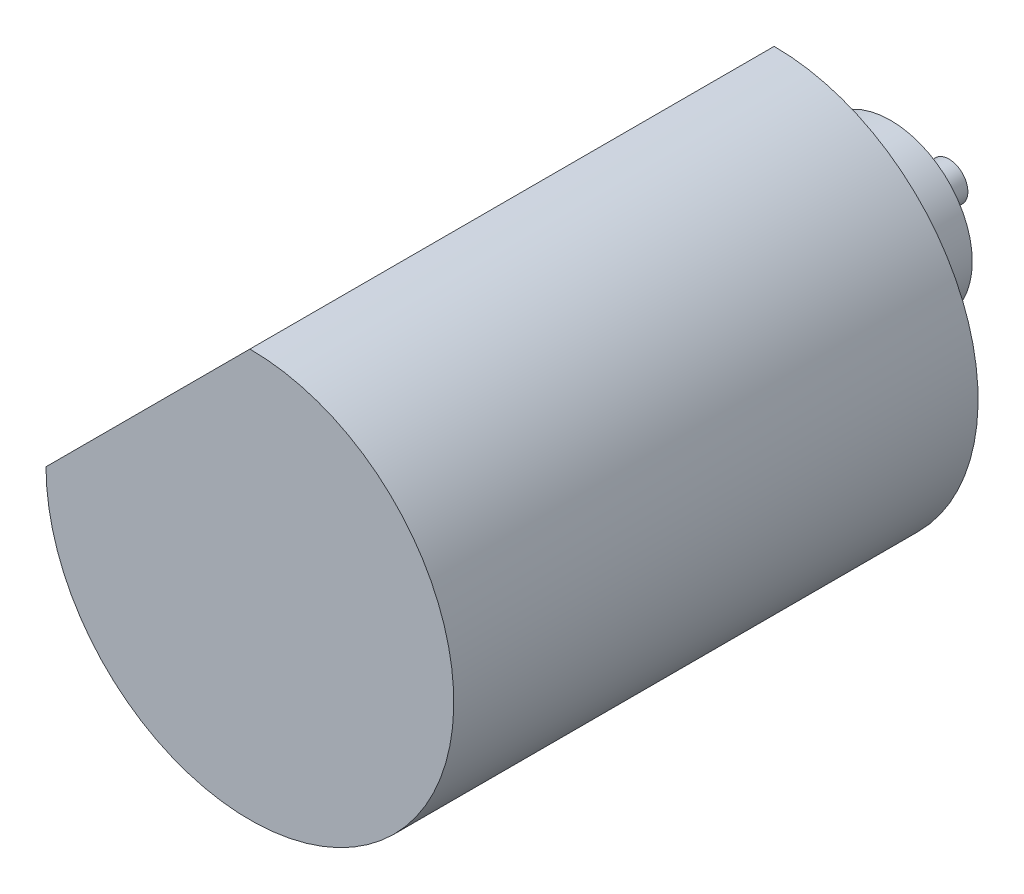
ISO-10303-21;
HEADER;
FILE_DESCRIPTION(('STEP AP214'),'2;1');
FILE_NAME('part.step','',(''),(''),'','','');
FILE_SCHEMA(('AUTOMOTIVE_DESIGN { 1 0 10303 214 1 1 1 1 }'));
ENDSEC;
DATA;
#1=APPLICATION_CONTEXT('core data for automotive mechanical design processes');
#2=APPLICATION_PROTOCOL_DEFINITION('international standard','automotive_design',2000,#1);
#3=PRODUCT_CONTEXT('',#1,'mechanical');
#4=PRODUCT('Part','Part','',(#3));
#5=PRODUCT_RELATED_PRODUCT_CATEGORY('part','',(#4));
#6=PRODUCT_DEFINITION_FORMATION('','',#4);
#7=PRODUCT_DEFINITION_CONTEXT('part definition',#1,'design');
#8=PRODUCT_DEFINITION('design','',#6,#7);
#9=PRODUCT_DEFINITION_SHAPE('','',#8);
#10=(LENGTH_UNIT() NAMED_UNIT(*) SI_UNIT(.MILLI.,.METRE.));
#11=(NAMED_UNIT(*) PLANE_ANGLE_UNIT() SI_UNIT($,.RADIAN.));
#12=(NAMED_UNIT(*) SI_UNIT($,.STERADIAN.) SOLID_ANGLE_UNIT());
#13=UNCERTAINTY_MEASURE_WITH_UNIT(LENGTH_MEASURE(1.E-05),#10,'distance_accuracy_value','');
#14=(GEOMETRIC_REPRESENTATION_CONTEXT(3) GLOBAL_UNCERTAINTY_ASSIGNED_CONTEXT((#13)) GLOBAL_UNIT_ASSIGNED_CONTEXT((#10,
#11,#12)) REPRESENTATION_CONTEXT('',''));
#15=CARTESIAN_POINT('',(0.,0.,0.));
#16=DIRECTION('',(0.,0.,1.));
#17=DIRECTION('',(1.,0.,0.));
#18=AXIS2_PLACEMENT_3D('',#15,#16,#17);
#19=CARTESIAN_POINT('',(0.,0.,45.));
#20=DIRECTION('',(0.,0.,-1.));
#21=DIRECTION('',(-1.,0.,0.));
#22=AXIS2_PLACEMENT_3D('',#19,#20,#21);
#23=CYLINDRICAL_SURFACE('',#22,17.5);
#24=CARTESIAN_POINT('',(0.,0.,0.));
#25=DIRECTION('',(0.,0.,1.));
#26=DIRECTION('',(1.,0.,0.));
#27=AXIS2_PLACEMENT_3D('',#24,#25,#26);
#28=CIRCLE('',#27,17.5);
#29=CARTESIAN_POINT('',(-17.5,0.,0.));
#30=VERTEX_POINT('',#29);
#31=CARTESIAN_POINT('',(0.,17.5,0.));
#32=VERTEX_POINT('',#31);
#33=EDGE_CURVE('E68',#30,#32,#28,.T.);
#34=ORIENTED_EDGE('',*,*,#33,.T.);
#35=DIRECTION('',(0.,0.,-1.));
#36=VECTOR('',#35,1.);
#37=CARTESIAN_POINT('',(0.,17.5,45.));
#38=LINE('',#37,#36);
#39=CARTESIAN_POINT('',(0.,17.5,45.));
#40=VERTEX_POINT('',#39);
#41=EDGE_CURVE('E43',#40,#32,#38,.T.);
#42=ORIENTED_EDGE('',*,*,#41,.F.);
#43=CARTESIAN_POINT('',(0.,0.,45.));
#44=DIRECTION('',(0.,0.,1.));
#45=DIRECTION('',(1.,0.,0.));
#46=AXIS2_PLACEMENT_3D('',#43,#44,#45);
#47=CIRCLE('',#46,17.5);
#48=CARTESIAN_POINT('',(-17.5,0.,45.));
#49=VERTEX_POINT('',#48);
#50=EDGE_CURVE('E67',#49,#40,#47,.T.);
#51=ORIENTED_EDGE('',*,*,#50,.F.);
#52=DIRECTION('',(0.,0.,-1.));
#53=VECTOR('',#52,1.);
#54=CARTESIAN_POINT('',(-17.5,0.,45.));
#55=LINE('',#54,#53);
#56=EDGE_CURVE('E63',#49,#30,#55,.T.);
#57=ORIENTED_EDGE('',*,*,#56,.T.);
#58=EDGE_LOOP('',(#34,#42,#51,#57));
#59=FACE_BOUND('',#58,.T.);
#60=ADVANCED_FACE('F35',(#59),#23,.T.);
#61=CARTESIAN_POINT('',(0.,17.5,45.));
#62=DIRECTION('',(0.707106781186546,-0.707106781186549,0.));
#63=DIRECTION('',(0.707106781186549,0.707106781186546,0.));
#64=AXIS2_PLACEMENT_3D('',#61,#62,#63);
#65=PLANE('',#64);
#66=DIRECTION('',(-0.707106781186549,-0.707106781186546,0.));
#67=VECTOR('',#66,1.);
#68=CARTESIAN_POINT('',(0.,17.5,0.));
#69=LINE('',#68,#67);
#70=EDGE_CURVE('E58',#32,#30,#69,.T.);
#71=ORIENTED_EDGE('',*,*,#70,.T.);
#72=ORIENTED_EDGE('',*,*,#56,.F.);
#73=DIRECTION('',(-0.707106781186549,-0.707106781186546,0.));
#74=VECTOR('',#73,1.);
#75=CARTESIAN_POINT('',(0.,17.5,45.));
#76=LINE('',#75,#74);
#77=EDGE_CURVE('E50',#40,#49,#76,.T.);
#78=ORIENTED_EDGE('',*,*,#77,.F.);
#79=ORIENTED_EDGE('',*,*,#41,.T.);
#80=EDGE_LOOP('',(#71,#72,#78,#79));
#81=FACE_BOUND('',#80,.T.);
#82=ADVANCED_FACE('F62',(#81),#65,.F.);
#83=CARTESIAN_POINT('',(0.,0.,45.));
#84=DIRECTION('',(0.,0.,1.));
#85=DIRECTION('',(1.,0.,0.));
#86=AXIS2_PLACEMENT_3D('',#83,#84,#85);
#87=PLANE('',#86);
#88=ORIENTED_EDGE('',*,*,#50,.T.);
#89=ORIENTED_EDGE('',*,*,#77,.T.);
#90=EDGE_LOOP('',(#88,#89));
#91=FACE_BOUND('',#90,.T.);
#92=ADVANCED_FACE('F89',(#91),#87,.T.);
#93=CARTESIAN_POINT('',(0.,0.,0.));
#94=DIRECTION('',(0.,0.,1.));
#95=DIRECTION('',(1.,0.,0.));
#96=AXIS2_PLACEMENT_3D('',#93,#94,#95);
#97=PLANE('',#96);
#98=CARTESIAN_POINT('',(0.,0.,0.));
#99=DIRECTION('',(0.,0.,1.));
#100=DIRECTION('',(1.,0.,0.));
#101=AXIS2_PLACEMENT_3D('',#98,#99,#100);
#102=CIRCLE('',#101,7.);
#103=CARTESIAN_POINT('',(7.,0.,0.));
#104=VERTEX_POINT('',#103);
#105=EDGE_CURVE('E11',#104,#104,#102,.F.);
#106=ORIENTED_EDGE('',*,*,#105,.F.);
#107=EDGE_LOOP('',(#106));
#108=FACE_BOUND('',#107,.T.);
#109=ORIENTED_EDGE('',*,*,#33,.F.);
#110=ORIENTED_EDGE('',*,*,#70,.F.);
#111=EDGE_LOOP('',(#109,#110));
#112=FACE_BOUND('',#111,.T.);
#113=ADVANCED_FACE('F72',(#108,#112),#97,.F.);
#114=CARTESIAN_POINT('',(0.,0.,-10.));
#115=DIRECTION('',(0.,0.,1.));
#116=DIRECTION('',(1.,0.,0.));
#117=AXIS2_PLACEMENT_3D('',#114,#115,#116);
#118=CYLINDRICAL_SURFACE('',#117,7.);
#119=CARTESIAN_POINT('',(0.,0.,-10.));
#120=DIRECTION('',(0.,0.,-1.));
#121=DIRECTION('',(-1.,0.,0.));
#122=AXIS2_PLACEMENT_3D('',#119,#120,#121);
#123=CIRCLE('',#122,7.);
#124=CARTESIAN_POINT('',(-7.,0.,-10.));
#125=VERTEX_POINT('',#124);
#126=EDGE_CURVE('E82',#125,#125,#123,.T.);
#127=ORIENTED_EDGE('',*,*,#126,.F.);
#128=EDGE_LOOP('',(#127));
#129=FACE_BOUND('',#128,.T.);
#130=ORIENTED_EDGE('',*,*,#105,.T.);
#131=EDGE_LOOP('',(#130));
#132=FACE_BOUND('',#131,.T.);
#133=ADVANCED_FACE('F97',(#129,#132),#118,.T.);
#134=CARTESIAN_POINT('',(0.,0.,-10.));
#135=DIRECTION('',(0.,0.,-1.));
#136=DIRECTION('',(-1.,0.,0.));
#137=AXIS2_PLACEMENT_3D('',#134,#135,#136);
#138=PLANE('',#137);
#139=CARTESIAN_POINT('',(0.,0.,-10.));
#140=DIRECTION('',(0.,0.,-1.));
#141=DIRECTION('',(-1.,0.,0.));
#142=AXIS2_PLACEMENT_3D('',#139,#140,#141);
#143=CIRCLE('',#142,1.625);
#144=CARTESIAN_POINT('',(-1.625,0.,-10.));
#145=VERTEX_POINT('',#144);
#146=EDGE_CURVE('E76',#145,#145,#143,.T.);
#147=ORIENTED_EDGE('',*,*,#146,.F.);
#148=EDGE_LOOP('',(#147));
#149=FACE_BOUND('',#148,.T.);
#150=ORIENTED_EDGE('',*,*,#126,.T.);
#151=EDGE_LOOP('',(#150));
#152=FACE_BOUND('',#151,.T.);
#153=ADVANCED_FACE('F123',(#149,#152),#138,.T.);
#154=CARTESIAN_POINT('',(0.,0.,-15.));
#155=DIRECTION('',(0.,0.,-1.));
#156=DIRECTION('',(-1.,0.,0.));
#157=AXIS2_PLACEMENT_3D('',#154,#155,#156);
#158=PLANE('',#157);
#159=CARTESIAN_POINT('',(0.,0.,-15.));
#160=DIRECTION('',(0.,0.,-1.));
#161=DIRECTION('',(-1.,0.,0.));
#162=AXIS2_PLACEMENT_3D('',#159,#160,#161);
#163=CIRCLE('',#162,1.625);
#164=CARTESIAN_POINT('',(-1.625,0.,-15.));
#165=VERTEX_POINT('',#164);
#166=EDGE_CURVE('E73',#165,#165,#163,.T.);
#167=ORIENTED_EDGE('',*,*,#166,.T.);
#168=EDGE_LOOP('',(#167));
#169=FACE_BOUND('',#168,.T.);
#170=ADVANCED_FACE('F118',(#169),#158,.T.);
#171=CARTESIAN_POINT('',(0.,0.,-15.));
#172=DIRECTION('',(0.,0.,1.));
#173=DIRECTION('',(1.,0.,0.));
#174=AXIS2_PLACEMENT_3D('',#171,#172,#173);
#175=CYLINDRICAL_SURFACE('',#174,1.625);
#176=ORIENTED_EDGE('',*,*,#146,.T.);
#177=EDGE_LOOP('',(#176));
#178=FACE_BOUND('',#177,.T.);
#179=ORIENTED_EDGE('',*,*,#166,.F.);
#180=EDGE_LOOP('',(#179));
#181=FACE_BOUND('',#180,.T.);
#182=ADVANCED_FACE('F122',(#178,#181),#175,.T.);
#183=CLOSED_SHELL('',(#60,#82,#92,#113,#133,#153,#170,#182));
#184=MANIFOLD_SOLID_BREP('B2',#183);
#185=ADVANCED_BREP_SHAPE_REPRESENTATION('',(#18,#184),#14);
#186=SHAPE_DEFINITION_REPRESENTATION(#9,#185);
ENDSEC;
END-ISO-10303-21;
